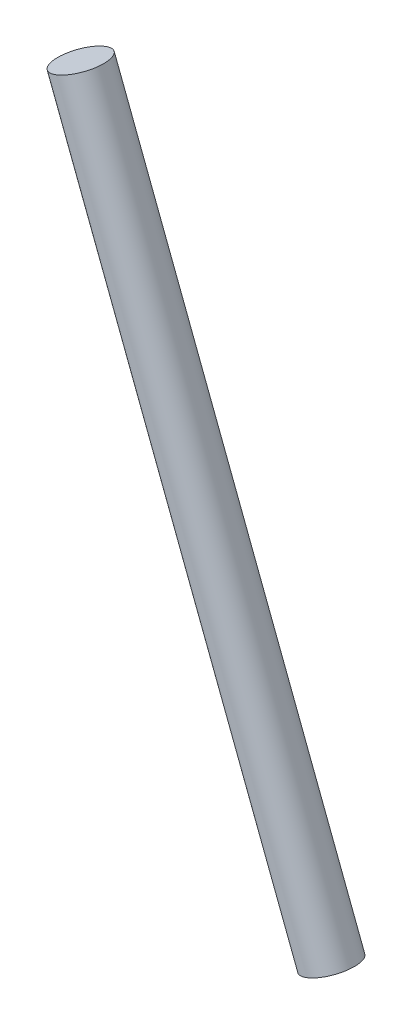
ISO-10303-21;
HEADER;
FILE_DESCRIPTION(('STEP AP214'),'2;1');
FILE_NAME('part.step','',(''),(''),'','','');
FILE_SCHEMA(('AUTOMOTIVE_DESIGN { 1 0 10303 214 1 1 1 1 }'));
ENDSEC;
DATA;
#1=APPLICATION_CONTEXT('core data for automotive mechanical design processes');
#2=APPLICATION_PROTOCOL_DEFINITION('international standard','automotive_design',2000,#1);
#3=PRODUCT_CONTEXT('',#1,'mechanical');
#4=PRODUCT('Part','Part','',(#3));
#5=PRODUCT_RELATED_PRODUCT_CATEGORY('part','',(#4));
#6=PRODUCT_DEFINITION_FORMATION('','',#4);
#7=PRODUCT_DEFINITION_CONTEXT('part definition',#1,'design');
#8=PRODUCT_DEFINITION('design','',#6,#7);
#9=PRODUCT_DEFINITION_SHAPE('','',#8);
#10=(LENGTH_UNIT() NAMED_UNIT(*) SI_UNIT(.MILLI.,.METRE.));
#11=(NAMED_UNIT(*) PLANE_ANGLE_UNIT() SI_UNIT($,.RADIAN.));
#12=(NAMED_UNIT(*) SI_UNIT($,.STERADIAN.) SOLID_ANGLE_UNIT());
#13=UNCERTAINTY_MEASURE_WITH_UNIT(LENGTH_MEASURE(1.E-05),#10,'distance_accuracy_value','');
#14=(GEOMETRIC_REPRESENTATION_CONTEXT(3) GLOBAL_UNCERTAINTY_ASSIGNED_CONTEXT((#13)) GLOBAL_UNIT_ASSIGNED_CONTEXT((#10,
#11,#12)) REPRESENTATION_CONTEXT('',''));
#15=CARTESIAN_POINT('',(0.,0.,0.));
#16=DIRECTION('',(0.,0.,1.));
#17=DIRECTION('',(1.,0.,0.));
#18=AXIS2_PLACEMENT_3D('',#15,#16,#17);
#19=CARTESIAN_POINT('',(528.957132439168,720.206031852312,0.));
#20=DIRECTION('',(-0.356683910717912,0.934225126955477,0.));
#21=DIRECTION('',(-0.934225126955477,-0.356683910717912,0.));
#22=AXIS2_PLACEMENT_3D('',#19,#20,#21);
#23=PLANE('',#22);
#24=CARTESIAN_POINT('',(536.075927906568,722.923963251982,0.));
#25=DIRECTION('',(-0.356683910717912,0.934225126955477,0.));
#26=DIRECTION('',(-0.934225126955477,-0.356683910717912,0.));
#27=AXIS2_PLACEMENT_3D('',#24,#25,#26);
#28=CIRCLE('',#27,7.61999999999995);
#29=CARTESIAN_POINT('',(528.957132439168,720.206031852312,0.));
#30=VERTEX_POINT('',#29);
#31=EDGE_CURVE('E37',#30,#30,#28,.T.);
#32=ORIENTED_EDGE('',*,*,#31,.T.);
#33=EDGE_LOOP('',(#32));
#34=FACE_BOUND('',#33,.T.);
#35=ADVANCED_FACE('F31',(#34),#23,.T.);
#36=CARTESIAN_POINT('',(606.581860379015,516.891643018438,0.));
#37=DIRECTION('',(0.356683910717912,-0.934225126955477,0.));
#38=DIRECTION('',(0.934225126955477,0.356683910717912,0.));
#39=AXIS2_PLACEMENT_3D('',#36,#37,#38);
#40=PLANE('',#39);
#41=CARTESIAN_POINT('',(613.700655846416,519.609574418108,0.));
#42=DIRECTION('',(-0.356683910717912,0.934225126955477,0.));
#43=DIRECTION('',(-0.934225126955477,-0.356683910717912,0.));
#44=AXIS2_PLACEMENT_3D('',#41,#42,#43);
#45=CIRCLE('',#44,7.62);
#46=CARTESIAN_POINT('',(606.581860379016,516.891643018438,0.));
#47=VERTEX_POINT('',#46);
#48=EDGE_CURVE('E10',#47,#47,#45,.T.);
#49=ORIENTED_EDGE('',*,*,#48,.F.);
#50=EDGE_LOOP('',(#49));
#51=FACE_BOUND('',#50,.T.);
#52=ADVANCED_FACE('F46',(#51),#40,.T.);
#53=CARTESIAN_POINT('',(536.075927906568,722.923963251982,0.));
#54=DIRECTION('',(-0.356683910717912,0.934225126955477,0.));
#55=DIRECTION('',(-0.934225126955477,-0.356683910717912,0.));
#56=AXIS2_PLACEMENT_3D('',#53,#54,#55);
#57=CYLINDRICAL_SURFACE('',#56,7.62);
#58=ORIENTED_EDGE('',*,*,#48,.T.);
#59=EDGE_LOOP('',(#58));
#60=FACE_BOUND('',#59,.T.);
#61=ORIENTED_EDGE('',*,*,#31,.F.);
#62=EDGE_LOOP('',(#61));
#63=FACE_BOUND('',#62,.T.);
#64=ADVANCED_FACE('F44',(#60,#63),#57,.T.);
#65=CLOSED_SHELL('',(#35,#52,#64));
#66=MANIFOLD_SOLID_BREP('B2',#65);
#67=ADVANCED_BREP_SHAPE_REPRESENTATION('',(#18,#66),#14);
#68=SHAPE_DEFINITION_REPRESENTATION(#9,#67);
ENDSEC;
END-ISO-10303-21;
